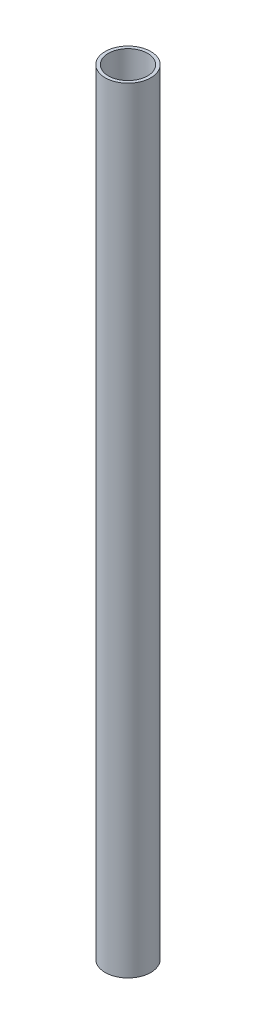
ISO-10303-21;
HEADER;
FILE_DESCRIPTION(('STEP AP214'),'2;1');
FILE_NAME('part.step','',(''),(''),'','','');
FILE_SCHEMA(('AUTOMOTIVE_DESIGN { 1 0 10303 214 1 1 1 1 }'));
ENDSEC;
DATA;
#1=APPLICATION_CONTEXT('core data for automotive mechanical design processes');
#2=APPLICATION_PROTOCOL_DEFINITION('international standard','automotive_design',2000,#1);
#3=PRODUCT_CONTEXT('',#1,'mechanical');
#4=PRODUCT('Part','Part','',(#3));
#5=PRODUCT_RELATED_PRODUCT_CATEGORY('part','',(#4));
#6=PRODUCT_DEFINITION_FORMATION('','',#4);
#7=PRODUCT_DEFINITION_CONTEXT('part definition',#1,'design');
#8=PRODUCT_DEFINITION('design','',#6,#7);
#9=PRODUCT_DEFINITION_SHAPE('','',#8);
#10=(LENGTH_UNIT() NAMED_UNIT(*) SI_UNIT(.MILLI.,.METRE.));
#11=(NAMED_UNIT(*) PLANE_ANGLE_UNIT() SI_UNIT($,.RADIAN.));
#12=(NAMED_UNIT(*) SI_UNIT($,.STERADIAN.) SOLID_ANGLE_UNIT());
#13=UNCERTAINTY_MEASURE_WITH_UNIT(LENGTH_MEASURE(1.E-05),#10,'distance_accuracy_value','');
#14=(GEOMETRIC_REPRESENTATION_CONTEXT(3) GLOBAL_UNCERTAINTY_ASSIGNED_CONTEXT((#13)) GLOBAL_UNIT_ASSIGNED_CONTEXT((#10,
#11,#12)) REPRESENTATION_CONTEXT('',''));
#15=CARTESIAN_POINT('',(0.,0.,0.));
#16=DIRECTION('',(0.,0.,1.));
#17=DIRECTION('',(1.,0.,0.));
#18=AXIS2_PLACEMENT_3D('',#15,#16,#17);
#19=CARTESIAN_POINT('',(0.,431.8,0.));
#20=DIRECTION('',(0.,-1.,0.));
#21=DIRECTION('',(0.,0.,-1.));
#22=AXIS2_PLACEMENT_3D('',#19,#20,#21);
#23=CYLINDRICAL_SURFACE('',#22,12.7);
#24=CARTESIAN_POINT('',(0.,431.8,0.));
#25=DIRECTION('',(0.,1.,0.));
#26=DIRECTION('',(0.,0.,1.));
#27=AXIS2_PLACEMENT_3D('',#24,#25,#26);
#28=CIRCLE('',#27,12.7);
#29=CARTESIAN_POINT('',(0.,431.8,12.7));
#30=VERTEX_POINT('',#29);
#31=EDGE_CURVE('E10',#30,#30,#28,.T.);
#32=ORIENTED_EDGE('',*,*,#31,.F.);
#33=EDGE_LOOP('',(#32));
#34=FACE_BOUND('',#33,.T.);
#35=CARTESIAN_POINT('',(0.,0.,0.));
#36=DIRECTION('',(0.,1.,0.));
#37=DIRECTION('',(0.,0.,1.));
#38=AXIS2_PLACEMENT_3D('',#35,#36,#37);
#39=CIRCLE('',#38,12.7);
#40=CARTESIAN_POINT('',(0.,0.,12.7));
#41=VERTEX_POINT('',#40);
#42=EDGE_CURVE('E36',#41,#41,#39,.T.);
#43=ORIENTED_EDGE('',*,*,#42,.T.);
#44=EDGE_LOOP('',(#43));
#45=FACE_BOUND('',#44,.T.);
#46=ADVANCED_FACE('F33',(#34,#45),#23,.T.);
#47=CARTESIAN_POINT('',(0.,431.8,0.));
#48=DIRECTION('',(0.,1.,0.));
#49=DIRECTION('',(0.,0.,1.));
#50=AXIS2_PLACEMENT_3D('',#47,#48,#49);
#51=PLANE('',#50);
#52=CARTESIAN_POINT('',(0.,431.8,0.));
#53=DIRECTION('',(0.,-1.,0.));
#54=DIRECTION('',(0.,0.,-1.));
#55=AXIS2_PLACEMENT_3D('',#52,#53,#54);
#56=CIRCLE('',#55,10.922);
#57=CARTESIAN_POINT('',(0.,431.8,-10.922));
#58=VERTEX_POINT('',#57);
#59=EDGE_CURVE('E43',#58,#58,#56,.T.);
#60=ORIENTED_EDGE('',*,*,#59,.T.);
#61=EDGE_LOOP('',(#60));
#62=FACE_BOUND('',#61,.T.);
#63=ORIENTED_EDGE('',*,*,#31,.T.);
#64=EDGE_LOOP('',(#63));
#65=FACE_BOUND('',#64,.T.);
#66=ADVANCED_FACE('F51',(#62,#65),#51,.T.);
#67=CARTESIAN_POINT('',(0.,0.,0.));
#68=DIRECTION('',(0.,1.,0.));
#69=DIRECTION('',(0.,0.,1.));
#70=AXIS2_PLACEMENT_3D('',#67,#68,#69);
#71=PLANE('',#70);
#72=CARTESIAN_POINT('',(0.,0.,0.));
#73=DIRECTION('',(0.,-1.,0.));
#74=DIRECTION('',(0.,0.,-1.));
#75=AXIS2_PLACEMENT_3D('',#72,#73,#74);
#76=CIRCLE('',#75,10.922);
#77=CARTESIAN_POINT('',(0.,0.,-10.922));
#78=VERTEX_POINT('',#77);
#79=EDGE_CURVE('E45',#78,#78,#76,.T.);
#80=ORIENTED_EDGE('',*,*,#79,.F.);
#81=EDGE_LOOP('',(#80));
#82=FACE_BOUND('',#81,.T.);
#83=ORIENTED_EDGE('',*,*,#42,.F.);
#84=EDGE_LOOP('',(#83));
#85=FACE_BOUND('',#84,.T.);
#86=ADVANCED_FACE('F56',(#82,#85),#71,.F.);
#87=CARTESIAN_POINT('',(0.,431.8,0.));
#88=DIRECTION('',(0.,-1.,0.));
#89=DIRECTION('',(0.,0.,-1.));
#90=AXIS2_PLACEMENT_3D('',#87,#88,#89);
#91=CYLINDRICAL_SURFACE('',#90,10.922);
#92=ORIENTED_EDGE('',*,*,#59,.F.);
#93=EDGE_LOOP('',(#92));
#94=FACE_BOUND('',#93,.T.);
#95=ORIENTED_EDGE('',*,*,#79,.T.);
#96=EDGE_LOOP('',(#95));
#97=FACE_BOUND('',#96,.T.);
#98=ADVANCED_FACE('F53',(#94,#97),#91,.F.);
#99=CLOSED_SHELL('',(#46,#66,#86,#98));
#100=MANIFOLD_SOLID_BREP('B2',#99);
#101=ADVANCED_BREP_SHAPE_REPRESENTATION('',(#18,#100),#14);
#102=SHAPE_DEFINITION_REPRESENTATION(#9,#101);
ENDSEC;
END-ISO-10303-21;
